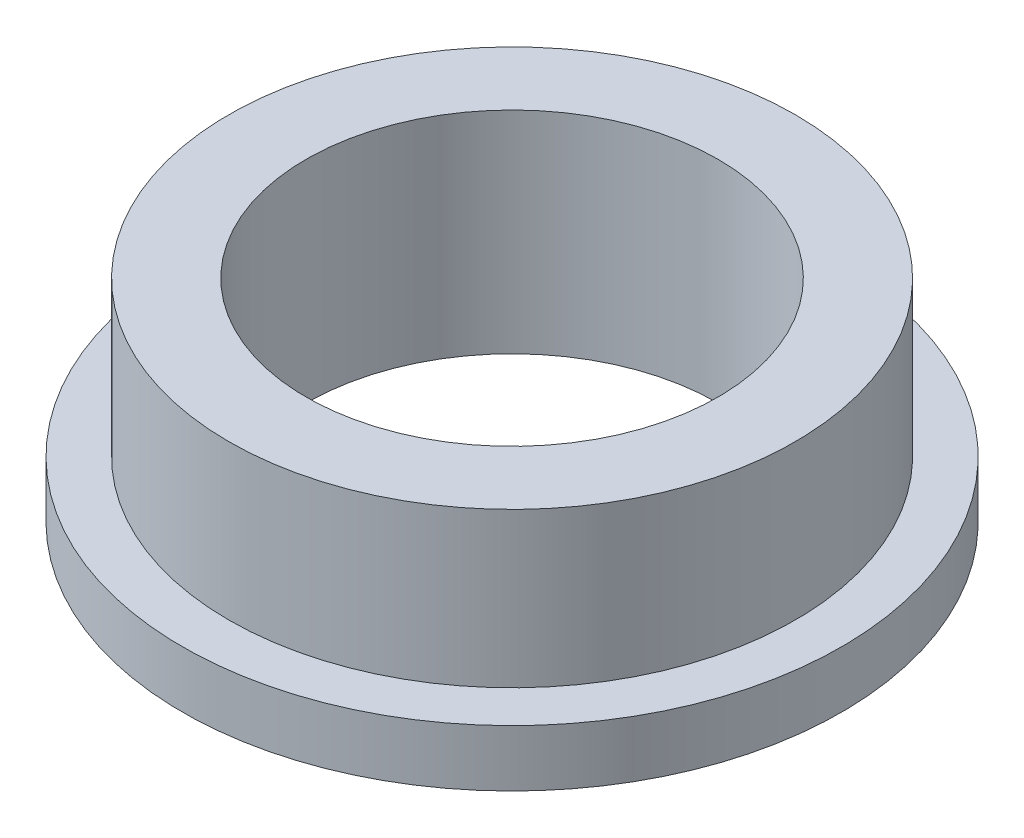
ISO-10303-21;
HEADER;
FILE_DESCRIPTION(('STEP AP214'),'2;1');
FILE_NAME('part.step','',(''),(''),'','','');
FILE_SCHEMA(('AUTOMOTIVE_DESIGN { 1 0 10303 214 1 1 1 1 }'));
ENDSEC;
DATA;
#1=APPLICATION_CONTEXT('core data for automotive mechanical design processes');
#2=APPLICATION_PROTOCOL_DEFINITION('international standard','automotive_design',2000,#1);
#3=PRODUCT_CONTEXT('',#1,'mechanical');
#4=PRODUCT('Part','Part','',(#3));
#5=PRODUCT_RELATED_PRODUCT_CATEGORY('part','',(#4));
#6=PRODUCT_DEFINITION_FORMATION('','',#4);
#7=PRODUCT_DEFINITION_CONTEXT('part definition',#1,'design');
#8=PRODUCT_DEFINITION('design','',#6,#7);
#9=PRODUCT_DEFINITION_SHAPE('','',#8);
#10=(LENGTH_UNIT() NAMED_UNIT(*) SI_UNIT(.MILLI.,.METRE.));
#11=(NAMED_UNIT(*) PLANE_ANGLE_UNIT() SI_UNIT($,.RADIAN.));
#12=(NAMED_UNIT(*) SI_UNIT($,.STERADIAN.) SOLID_ANGLE_UNIT());
#13=UNCERTAINTY_MEASURE_WITH_UNIT(LENGTH_MEASURE(1.E-05),#10,'distance_accuracy_value','');
#14=(GEOMETRIC_REPRESENTATION_CONTEXT(3) GLOBAL_UNCERTAINTY_ASSIGNED_CONTEXT((#13)) GLOBAL_UNIT_ASSIGNED_CONTEXT((#10,
#11,#12)) REPRESENTATION_CONTEXT('',''));
#15=CARTESIAN_POINT('',(0.,0.,0.));
#16=DIRECTION('',(0.,0.,1.));
#17=DIRECTION('',(1.,0.,0.));
#18=AXIS2_PLACEMENT_3D('',#15,#16,#17);
#19=CARTESIAN_POINT('',(0.,0.,0.));
#20=DIRECTION('',(0.,-1.,0.));
#21=DIRECTION('',(0.,0.,-1.));
#22=AXIS2_PLACEMENT_3D('',#19,#20,#21);
#23=CYLINDRICAL_SURFACE('',#22,6.4);
#24=CARTESIAN_POINT('',(0.,0.,0.));
#25=DIRECTION('',(0.,-1.,0.));
#26=DIRECTION('',(0.,0.,-1.));
#27=AXIS2_PLACEMENT_3D('',#24,#25,#26);
#28=CIRCLE('',#27,6.4);
#29=CARTESIAN_POINT('',(0.,0.,-6.4));
#30=VERTEX_POINT('',#29);
#31=EDGE_CURVE('E10',#30,#30,#28,.T.);
#32=ORIENTED_EDGE('',*,*,#31,.F.);
#33=EDGE_LOOP('',(#32));
#34=FACE_BOUND('',#33,.T.);
#35=CARTESIAN_POINT('',(0.,1.1,0.));
#36=DIRECTION('',(0.,-1.,0.));
#37=DIRECTION('',(0.,0.,-1.));
#38=AXIS2_PLACEMENT_3D('',#35,#36,#37);
#39=CIRCLE('',#38,6.4);
#40=CARTESIAN_POINT('',(0.,1.1,-6.4));
#41=VERTEX_POINT('',#40);
#42=EDGE_CURVE('E68',#41,#41,#39,.T.);
#43=ORIENTED_EDGE('',*,*,#42,.T.);
#44=EDGE_LOOP('',(#43));
#45=FACE_BOUND('',#44,.T.);
#46=ADVANCED_FACE('F41',(#34,#45),#23,.T.);
#47=CARTESIAN_POINT('',(-6.4,0.,0.));
#48=DIRECTION('',(0.,1.,0.));
#49=DIRECTION('',(0.,0.,1.));
#50=AXIS2_PLACEMENT_3D('',#47,#48,#49);
#51=PLANE('',#50);
#52=CARTESIAN_POINT('',(0.,0.,0.));
#53=DIRECTION('',(0.,-1.,0.));
#54=DIRECTION('',(0.,0.,-1.));
#55=AXIS2_PLACEMENT_3D('',#52,#53,#54);
#56=CIRCLE('',#55,4.);
#57=CARTESIAN_POINT('',(0.,0.,-4.));
#58=VERTEX_POINT('',#57);
#59=EDGE_CURVE('E48',#58,#58,#56,.T.);
#60=ORIENTED_EDGE('',*,*,#59,.F.);
#61=EDGE_LOOP('',(#60));
#62=FACE_BOUND('',#61,.T.);
#63=ORIENTED_EDGE('',*,*,#31,.T.);
#64=EDGE_LOOP('',(#63));
#65=FACE_BOUND('',#64,.T.);
#66=ADVANCED_FACE('F94',(#62,#65),#51,.F.);
#67=CARTESIAN_POINT('',(0.,0.,0.));
#68=DIRECTION('',(0.,-1.,0.));
#69=DIRECTION('',(0.,0.,-1.));
#70=AXIS2_PLACEMENT_3D('',#67,#68,#69);
#71=CYLINDRICAL_SURFACE('',#70,4.);
#72=CARTESIAN_POINT('',(0.,4.1,0.));
#73=DIRECTION('',(0.,-1.,0.));
#74=DIRECTION('',(0.,0.,-1.));
#75=AXIS2_PLACEMENT_3D('',#72,#73,#74);
#76=CIRCLE('',#75,4.);
#77=CARTESIAN_POINT('',(0.,4.1,-4.));
#78=VERTEX_POINT('',#77);
#79=EDGE_CURVE('E53',#78,#78,#76,.T.);
#80=ORIENTED_EDGE('',*,*,#79,.F.);
#81=EDGE_LOOP('',(#80));
#82=FACE_BOUND('',#81,.T.);
#83=ORIENTED_EDGE('',*,*,#59,.T.);
#84=EDGE_LOOP('',(#83));
#85=FACE_BOUND('',#84,.T.);
#86=ADVANCED_FACE('F89',(#82,#85),#71,.F.);
#87=CARTESIAN_POINT('',(-4.,4.1,0.));
#88=DIRECTION('',(0.,-1.,0.));
#89=DIRECTION('',(0.,0.,-1.));
#90=AXIS2_PLACEMENT_3D('',#87,#88,#89);
#91=PLANE('',#90);
#92=CARTESIAN_POINT('',(0.,4.1,0.));
#93=DIRECTION('',(0.,-1.,0.));
#94=DIRECTION('',(0.,0.,-1.));
#95=AXIS2_PLACEMENT_3D('',#92,#93,#94);
#96=CIRCLE('',#95,5.5);
#97=CARTESIAN_POINT('',(0.,4.1,-5.5));
#98=VERTEX_POINT('',#97);
#99=EDGE_CURVE('E58',#98,#98,#96,.T.);
#100=ORIENTED_EDGE('',*,*,#99,.F.);
#101=EDGE_LOOP('',(#100));
#102=FACE_BOUND('',#101,.T.);
#103=ORIENTED_EDGE('',*,*,#79,.T.);
#104=EDGE_LOOP('',(#103));
#105=FACE_BOUND('',#104,.T.);
#106=ADVANCED_FACE('F83',(#102,#105),#91,.F.);
#107=CARTESIAN_POINT('',(0.,0.,0.));
#108=DIRECTION('',(0.,-1.,0.));
#109=DIRECTION('',(0.,0.,-1.));
#110=AXIS2_PLACEMENT_3D('',#107,#108,#109);
#111=CYLINDRICAL_SURFACE('',#110,5.5);
#112=CARTESIAN_POINT('',(0.,1.1,0.));
#113=DIRECTION('',(0.,-1.,0.));
#114=DIRECTION('',(0.,0.,-1.));
#115=AXIS2_PLACEMENT_3D('',#112,#113,#114);
#116=CIRCLE('',#115,5.5);
#117=CARTESIAN_POINT('',(0.,1.1,-5.5));
#118=VERTEX_POINT('',#117);
#119=EDGE_CURVE('E64',#118,#118,#116,.T.);
#120=ORIENTED_EDGE('',*,*,#119,.F.);
#121=EDGE_LOOP('',(#120));
#122=FACE_BOUND('',#121,.T.);
#123=ORIENTED_EDGE('',*,*,#99,.T.);
#124=EDGE_LOOP('',(#123));
#125=FACE_BOUND('',#124,.T.);
#126=ADVANCED_FACE('F77',(#122,#125),#111,.T.);
#127=CARTESIAN_POINT('',(-5.5,1.1,0.));
#128=DIRECTION('',(0.,-1.,0.));
#129=DIRECTION('',(0.,0.,-1.));
#130=AXIS2_PLACEMENT_3D('',#127,#128,#129);
#131=PLANE('',#130);
#132=ORIENTED_EDGE('',*,*,#42,.F.);
#133=EDGE_LOOP('',(#132));
#134=FACE_BOUND('',#133,.T.);
#135=ORIENTED_EDGE('',*,*,#119,.T.);
#136=EDGE_LOOP('',(#135));
#137=FACE_BOUND('',#136,.T.);
#138=ADVANCED_FACE('F74',(#134,#137),#131,.F.);
#139=CLOSED_SHELL('',(#46,#66,#86,#106,#126,#138));
#140=MANIFOLD_SOLID_BREP('B2',#139);
#141=ADVANCED_BREP_SHAPE_REPRESENTATION('',(#18,#140),#14);
#142=SHAPE_DEFINITION_REPRESENTATION(#9,#141);
ENDSEC;
END-ISO-10303-21;
